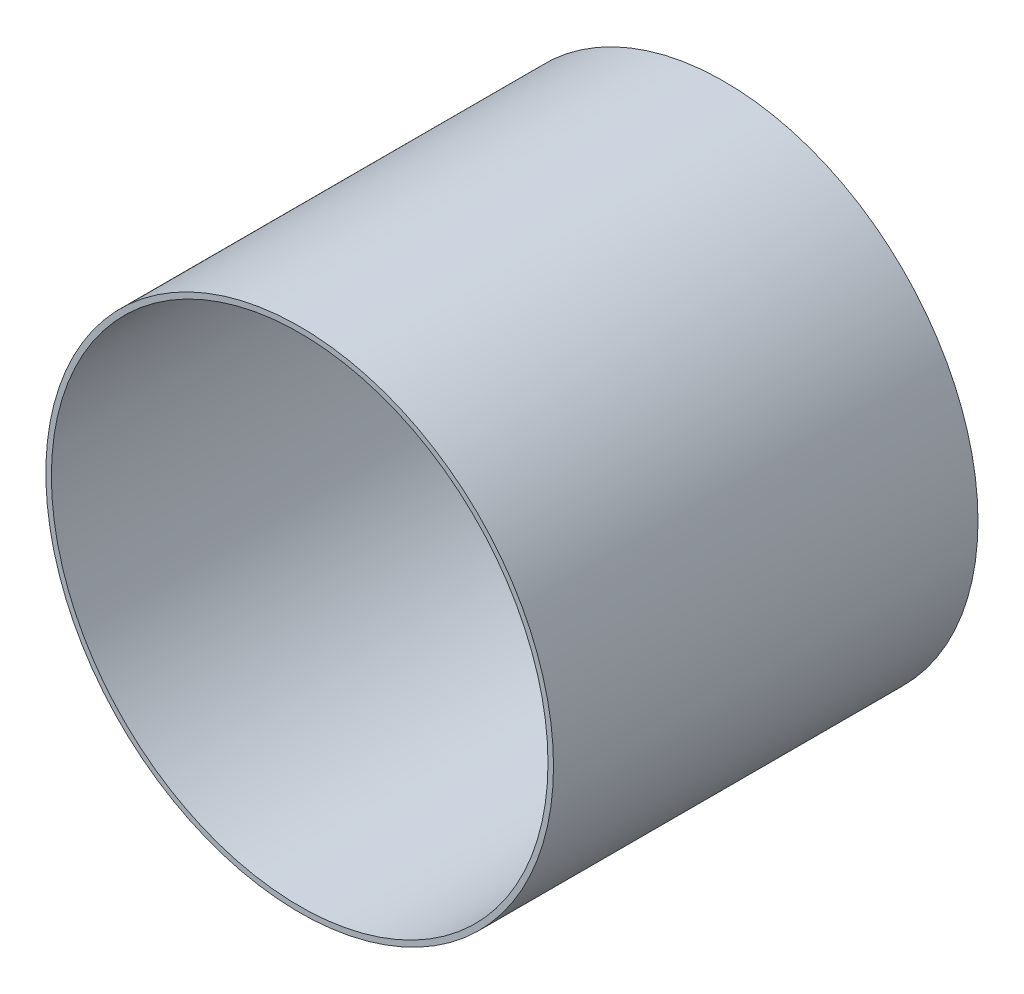
ISO-10303-21;
HEADER;
FILE_DESCRIPTION(('STEP AP214'),'2;1');
FILE_NAME('part.step','',(''),(''),'','','');
FILE_SCHEMA(('AUTOMOTIVE_DESIGN { 1 0 10303 214 1 1 1 1 }'));
ENDSEC;
DATA;
#1=APPLICATION_CONTEXT('core data for automotive mechanical design processes');
#2=APPLICATION_PROTOCOL_DEFINITION('international standard','automotive_design',2000,#1);
#3=PRODUCT_CONTEXT('',#1,'mechanical');
#4=PRODUCT('Part','Part','',(#3));
#5=PRODUCT_RELATED_PRODUCT_CATEGORY('part','',(#4));
#6=PRODUCT_DEFINITION_FORMATION('','',#4);
#7=PRODUCT_DEFINITION_CONTEXT('part definition',#1,'design');
#8=PRODUCT_DEFINITION('design','',#6,#7);
#9=PRODUCT_DEFINITION_SHAPE('','',#8);
#10=(LENGTH_UNIT() NAMED_UNIT(*) SI_UNIT(.MILLI.,.METRE.));
#11=(NAMED_UNIT(*) PLANE_ANGLE_UNIT() SI_UNIT($,.RADIAN.));
#12=(NAMED_UNIT(*) SI_UNIT($,.STERADIAN.) SOLID_ANGLE_UNIT());
#13=UNCERTAINTY_MEASURE_WITH_UNIT(LENGTH_MEASURE(1.E-05),#10,'distance_accuracy_value','');
#14=(GEOMETRIC_REPRESENTATION_CONTEXT(3) GLOBAL_UNCERTAINTY_ASSIGNED_CONTEXT((#13)) GLOBAL_UNIT_ASSIGNED_CONTEXT((#10,
#11,#12)) REPRESENTATION_CONTEXT('',''));
#15=CARTESIAN_POINT('',(0.,0.,0.));
#16=DIRECTION('',(0.,0.,1.));
#17=DIRECTION('',(1.,0.,0.));
#18=AXIS2_PLACEMENT_3D('',#15,#16,#17);
#19=CARTESIAN_POINT('',(0.,0.,127.));
#20=DIRECTION('',(0.,0.,1.));
#21=DIRECTION('',(1.,0.,0.));
#22=AXIS2_PLACEMENT_3D('',#19,#20,#21);
#23=PLANE('',#22);
#24=CARTESIAN_POINT('',(0.,0.,127.));
#25=DIRECTION('',(0.,0.,1.));
#26=DIRECTION('',(1.,0.,0.));
#27=AXIS2_PLACEMENT_3D('',#24,#25,#26);
#28=CIRCLE('',#27,75.946);
#29=CARTESIAN_POINT('',(75.946,0.,127.));
#30=VERTEX_POINT('',#29);
#31=EDGE_CURVE('E10',#30,#30,#28,.T.);
#32=ORIENTED_EDGE('',*,*,#31,.T.);
#33=EDGE_LOOP('',(#32));
#34=FACE_BOUND('',#33,.T.);
#35=CARTESIAN_POINT('',(0.,0.,127.));
#36=DIRECTION('',(0.,0.,1.));
#37=DIRECTION('',(1.,0.,0.));
#38=AXIS2_PLACEMENT_3D('',#35,#36,#37);
#39=CIRCLE('',#38,74.295);
#40=CARTESIAN_POINT('',(74.295,0.,127.));
#41=VERTEX_POINT('',#40);
#42=EDGE_CURVE('E56',#41,#41,#39,.T.);
#43=ORIENTED_EDGE('',*,*,#42,.F.);
#44=EDGE_LOOP('',(#43));
#45=FACE_BOUND('',#44,.T.);
#46=ADVANCED_FACE('F43',(#34,#45),#23,.T.);
#47=CARTESIAN_POINT('',(0.,0.,0.));
#48=DIRECTION('',(0.,0.,1.));
#49=DIRECTION('',(1.,0.,0.));
#50=AXIS2_PLACEMENT_3D('',#47,#48,#49);
#51=PLANE('',#50);
#52=CARTESIAN_POINT('',(0.,0.,0.));
#53=DIRECTION('',(0.,0.,1.));
#54=DIRECTION('',(1.,0.,0.));
#55=AXIS2_PLACEMENT_3D('',#52,#53,#54);
#56=CIRCLE('',#55,75.946);
#57=CARTESIAN_POINT('',(75.946,0.,0.));
#58=VERTEX_POINT('',#57);
#59=EDGE_CURVE('E47',#58,#58,#56,.T.);
#60=ORIENTED_EDGE('',*,*,#59,.F.);
#61=EDGE_LOOP('',(#60));
#62=FACE_BOUND('',#61,.T.);
#63=CARTESIAN_POINT('',(0.,0.,0.));
#64=DIRECTION('',(0.,0.,1.));
#65=DIRECTION('',(1.,0.,0.));
#66=AXIS2_PLACEMENT_3D('',#63,#64,#65);
#67=CIRCLE('',#66,74.295);
#68=CARTESIAN_POINT('',(74.295,0.,0.));
#69=VERTEX_POINT('',#68);
#70=EDGE_CURVE('E58',#69,#69,#67,.T.);
#71=ORIENTED_EDGE('',*,*,#70,.T.);
#72=EDGE_LOOP('',(#71));
#73=FACE_BOUND('',#72,.T.);
#74=ADVANCED_FACE('F70',(#62,#73),#51,.F.);
#75=CARTESIAN_POINT('',(0.,0.,127.));
#76=DIRECTION('',(0.,0.,-1.));
#77=DIRECTION('',(-1.,0.,0.));
#78=AXIS2_PLACEMENT_3D('',#75,#76,#77);
#79=CYLINDRICAL_SURFACE('',#78,75.946);
#80=ORIENTED_EDGE('',*,*,#31,.F.);
#81=EDGE_LOOP('',(#80));
#82=FACE_BOUND('',#81,.T.);
#83=ORIENTED_EDGE('',*,*,#59,.T.);
#84=EDGE_LOOP('',(#83));
#85=FACE_BOUND('',#84,.T.);
#86=ADVANCED_FACE('F45',(#82,#85),#79,.T.);
#87=CARTESIAN_POINT('',(0.,0.,127.));
#88=DIRECTION('',(0.,0.,-1.));
#89=DIRECTION('',(-1.,0.,0.));
#90=AXIS2_PLACEMENT_3D('',#87,#88,#89);
#91=CYLINDRICAL_SURFACE('',#90,74.295);
#92=ORIENTED_EDGE('',*,*,#42,.T.);
#93=EDGE_LOOP('',(#92));
#94=FACE_BOUND('',#93,.T.);
#95=ORIENTED_EDGE('',*,*,#70,.F.);
#96=EDGE_LOOP('',(#95));
#97=FACE_BOUND('',#96,.T.);
#98=ADVANCED_FACE('F66',(#94,#97),#91,.F.);
#99=CLOSED_SHELL('',(#46,#74,#86,#98));
#100=MANIFOLD_SOLID_BREP('B2',#99);
#101=ADVANCED_BREP_SHAPE_REPRESENTATION('',(#18,#100),#14);
#102=SHAPE_DEFINITION_REPRESENTATION(#9,#101);
ENDSEC;
END-ISO-10303-21;
